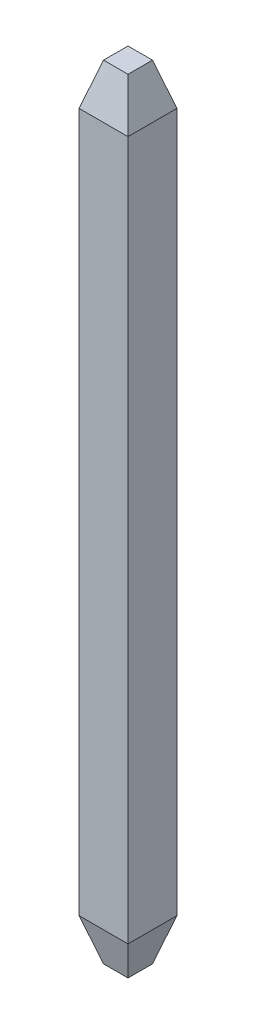
ISO-10303-21;
HEADER;
FILE_DESCRIPTION(('STEP AP214'),'2;1');
FILE_NAME('part.step','',(''),(''),'','','');
FILE_SCHEMA(('AUTOMOTIVE_DESIGN { 1 0 10303 214 1 1 1 1 }'));
ENDSEC;
DATA;
#1=APPLICATION_CONTEXT('core data for automotive mechanical design processes');
#2=APPLICATION_PROTOCOL_DEFINITION('international standard','automotive_design',2000,#1);
#3=PRODUCT_CONTEXT('',#1,'mechanical');
#4=PRODUCT('Part','Part','',(#3));
#5=PRODUCT_RELATED_PRODUCT_CATEGORY('part','',(#4));
#6=PRODUCT_DEFINITION_FORMATION('','',#4);
#7=PRODUCT_DEFINITION_CONTEXT('part definition',#1,'design');
#8=PRODUCT_DEFINITION('design','',#6,#7);
#9=PRODUCT_DEFINITION_SHAPE('','',#8);
#10=(LENGTH_UNIT() NAMED_UNIT(*) SI_UNIT(.MILLI.,.METRE.));
#11=(NAMED_UNIT(*) PLANE_ANGLE_UNIT() SI_UNIT($,.RADIAN.));
#12=(NAMED_UNIT(*) SI_UNIT($,.STERADIAN.) SOLID_ANGLE_UNIT());
#13=UNCERTAINTY_MEASURE_WITH_UNIT(LENGTH_MEASURE(1.E-05),#10,'distance_accuracy_value','');
#14=(GEOMETRIC_REPRESENTATION_CONTEXT(3) GLOBAL_UNCERTAINTY_ASSIGNED_CONTEXT((#13)) GLOBAL_UNIT_ASSIGNED_CONTEXT((#10,
#11,#12)) REPRESENTATION_CONTEXT('',''));
#15=CARTESIAN_POINT('',(0.,0.,0.));
#16=DIRECTION('',(0.,0.,1.));
#17=DIRECTION('',(1.,0.,0.));
#18=AXIS2_PLACEMENT_3D('',#15,#16,#17);
#19=CARTESIAN_POINT('',(1.75000000001297,-0.965870106912661,-19.5199999999763));
#20=DIRECTION('',(0.959644900900968,0.281214622974643,0.));
#21=DIRECTION('',(0.,0.,-1.));
#22=AXIS2_PLACEMENT_3D('',#19,#20,#21);
#23=PLANE('',#22);
#24=DIRECTION('',(-0.270714017147727,0.923811583516618,0.270714017147727));
#25=VECTOR('',#24,1.);
#26=CARTESIAN_POINT('',(1.75000000001297,-0.965870106912661,-19.8399999999763));
#27=LINE('',#26,#25);
#28=CARTESIAN_POINT('',(1.75000000001294,-0.965870106912663,-19.8399999999763));
#29=VERTEX_POINT('',#28);
#30=CARTESIAN_POINT('',(1.59000000001294,-0.419870106912663,-19.6799999999763));
#31=VERTEX_POINT('',#30);
#32=EDGE_CURVE('E11',#29,#31,#27,.T.);
#33=ORIENTED_EDGE('',*,*,#32,.T.);
#34=DIRECTION('',(0.,0.,1.));
#35=VECTOR('',#34,1.);
#36=CARTESIAN_POINT('',(1.59000000001297,-0.419870106912661,-19.6799999999763));
#37=LINE('',#36,#35);
#38=CARTESIAN_POINT('',(1.59000000001294,-0.419870106912663,-19.3599999999763));
#39=VERTEX_POINT('',#38);
#40=EDGE_CURVE('E28',#31,#39,#37,.T.);
#41=ORIENTED_EDGE('',*,*,#40,.T.);
#42=DIRECTION('',(-0.270714017147727,0.923811583516618,-0.270714017147727));
#43=VECTOR('',#42,1.);
#44=CARTESIAN_POINT('',(1.75000000001297,-0.965870106912661,-19.1999999999763));
#45=LINE('',#44,#43);
#46=CARTESIAN_POINT('',(1.75000000001294,-0.965870106912663,-19.1999999999763));
#47=VERTEX_POINT('',#46);
#48=EDGE_CURVE('E149',#47,#39,#45,.T.);
#49=ORIENTED_EDGE('',*,*,#48,.F.);
#50=DIRECTION('',(0.,0.,1.));
#51=VECTOR('',#50,1.);
#52=CARTESIAN_POINT('',(1.75000000001297,-0.965870106912661,-19.8399999999763));
#53=LINE('',#52,#51);
#54=EDGE_CURVE('E144',#29,#47,#53,.T.);
#55=ORIENTED_EDGE('',*,*,#54,.F.);
#56=EDGE_LOOP('',(#33,#41,#49,#55));
#57=FACE_BOUND('',#56,.T.);
#58=ADVANCED_FACE('F17',(#57),#23,.T.);
#59=CARTESIAN_POINT('',(1.43000000001296,-0.965870106912661,-19.8399999999763));
#60=DIRECTION('',(0.,0.281214622974643,-0.959644900900968));
#61=DIRECTION('',(-1.,0.,0.));
#62=AXIS2_PLACEMENT_3D('',#59,#60,#61);
#63=PLANE('',#62);
#64=DIRECTION('',(0.270714017147727,0.923811583516618,0.270714017147727));
#65=VECTOR('',#64,1.);
#66=CARTESIAN_POINT('',(1.11000000001295,-0.965870106912661,-19.8399999999763));
#67=LINE('',#66,#65);
#68=CARTESIAN_POINT('',(1.11000000001295,-0.965870106912663,-19.8399999999763));
#69=VERTEX_POINT('',#68);
#70=CARTESIAN_POINT('',(1.27000000001295,-0.419870106912663,-19.6799999999763));
#71=VERTEX_POINT('',#70);
#72=EDGE_CURVE('E167',#69,#71,#67,.T.);
#73=ORIENTED_EDGE('',*,*,#72,.T.);
#74=DIRECTION('',(1.,0.,0.));
#75=VECTOR('',#74,1.);
#76=CARTESIAN_POINT('',(1.27000000001295,-0.419870106912661,-19.6799999999763));
#77=LINE('',#76,#75);
#78=EDGE_CURVE('E126',#71,#31,#77,.T.);
#79=ORIENTED_EDGE('',*,*,#78,.T.);
#80=ORIENTED_EDGE('',*,*,#32,.F.);
#81=DIRECTION('',(1.,0.,0.));
#82=VECTOR('',#81,1.);
#83=CARTESIAN_POINT('',(1.11000000001295,-0.965870106912661,-19.8399999999763));
#84=LINE('',#83,#82);
#85=EDGE_CURVE('E152',#69,#29,#84,.T.);
#86=ORIENTED_EDGE('',*,*,#85,.F.);
#87=EDGE_LOOP('',(#73,#79,#80,#86));
#88=FACE_BOUND('',#87,.T.);
#89=ADVANCED_FACE('F235',(#88),#63,.T.);
#90=CARTESIAN_POINT('',(1.11000000001295,-0.965870106912661,-19.5199999999763));
#91=DIRECTION('',(-0.959644900900968,0.281214622974643,0.));
#92=DIRECTION('',(0.,0.,1.));
#93=AXIS2_PLACEMENT_3D('',#90,#91,#92);
#94=PLANE('',#93);
#95=DIRECTION('',(0.270714017147727,0.923811583516618,-0.270714017147727));
#96=VECTOR('',#95,1.);
#97=CARTESIAN_POINT('',(1.11000000001295,-0.965870106912661,-19.1999999999763));
#98=LINE('',#97,#96);
#99=CARTESIAN_POINT('',(1.11000000001295,-0.965870106912663,-19.1999999999763));
#100=VERTEX_POINT('',#99);
#101=CARTESIAN_POINT('',(1.27000000001295,-0.419870106912663,-19.3599999999763));
#102=VERTEX_POINT('',#101);
#103=EDGE_CURVE('E180',#100,#102,#98,.T.);
#104=ORIENTED_EDGE('',*,*,#103,.T.);
#105=DIRECTION('',(0.,0.,-1.));
#106=VECTOR('',#105,1.);
#107=CARTESIAN_POINT('',(1.27000000001295,-0.419870106912661,-19.3599999999763));
#108=LINE('',#107,#106);
#109=EDGE_CURVE('E142',#102,#71,#108,.T.);
#110=ORIENTED_EDGE('',*,*,#109,.T.);
#111=ORIENTED_EDGE('',*,*,#72,.F.);
#112=DIRECTION('',(0.,0.,-1.));
#113=VECTOR('',#112,1.);
#114=CARTESIAN_POINT('',(1.11000000001295,-0.965870106912661,-19.1999999999763));
#115=LINE('',#114,#113);
#116=EDGE_CURVE('E143',#100,#69,#115,.T.);
#117=ORIENTED_EDGE('',*,*,#116,.F.);
#118=EDGE_LOOP('',(#104,#110,#111,#117));
#119=FACE_BOUND('',#118,.T.);
#120=ADVANCED_FACE('F214',(#119),#94,.T.);
#121=CARTESIAN_POINT('',(1.11000000001295,-5.53543505344793,-19.1989999999763));
#122=DIRECTION('',(-1.,0.,0.));
#123=DIRECTION('',(0.,0.,1.));
#124=AXIS2_PLACEMENT_3D('',#121,#122,#123);
#125=PLANE('',#124);
#126=DIRECTION('',(0.,1.,0.));
#127=VECTOR('',#126,1.);
#128=CARTESIAN_POINT('',(1.11000000001295,-10.1039999999832,-19.8399999999763));
#129=LINE('',#128,#127);
#130=CARTESIAN_POINT('',(1.11000000001295,-10.1039999999832,-19.8399999999763));
#131=VERTEX_POINT('',#130);
#132=EDGE_CURVE('E101',#131,#69,#129,.T.);
#133=ORIENTED_EDGE('',*,*,#132,.F.);
#134=DIRECTION('',(0.,0.,-1.));
#135=VECTOR('',#134,1.);
#136=CARTESIAN_POINT('',(1.11000000001295,-10.1039999999832,-19.1999999999763));
#137=LINE('',#136,#135);
#138=CARTESIAN_POINT('',(1.11000000001295,-10.1039999999832,-19.1999999999763));
#139=VERTEX_POINT('',#138);
#140=EDGE_CURVE('E96',#139,#131,#137,.T.);
#141=ORIENTED_EDGE('',*,*,#140,.F.);
#142=DIRECTION('',(0.,1.,0.));
#143=VECTOR('',#142,1.);
#144=CARTESIAN_POINT('',(1.11000000001295,-10.1039999999832,-19.1999999999763));
#145=LINE('',#144,#143);
#146=EDGE_CURVE('E138',#139,#100,#145,.T.);
#147=ORIENTED_EDGE('',*,*,#146,.T.);
#148=ORIENTED_EDGE('',*,*,#116,.T.);
#149=EDGE_LOOP('',(#133,#141,#147,#148));
#150=FACE_BOUND('',#149,.T.);
#151=ADVANCED_FACE('F218',(#150),#125,.T.);
#152=CARTESIAN_POINT('',(1.10900000001298,-5.53543505344793,-19.1999999999763));
#153=DIRECTION('',(0.,0.,1.));
#154=DIRECTION('',(1.,0.,0.));
#155=AXIS2_PLACEMENT_3D('',#152,#153,#154);
#156=PLANE('',#155);
#157=ORIENTED_EDGE('',*,*,#146,.F.);
#158=DIRECTION('',(-1.,0.,0.));
#159=VECTOR('',#158,1.);
#160=CARTESIAN_POINT('',(1.75000000001297,-10.1039999999832,-19.1999999999763));
#161=LINE('',#160,#159);
#162=CARTESIAN_POINT('',(1.75000000001294,-10.1039999999832,-19.1999999999763));
#163=VERTEX_POINT('',#162);
#164=EDGE_CURVE('E133',#163,#139,#161,.T.);
#165=ORIENTED_EDGE('',*,*,#164,.F.);
#166=DIRECTION('',(0.,1.,0.));
#167=VECTOR('',#166,1.);
#168=CARTESIAN_POINT('',(1.75000000001297,-10.1039999999832,-19.1999999999763));
#169=LINE('',#168,#167);
#170=EDGE_CURVE('E132',#163,#47,#169,.T.);
#171=ORIENTED_EDGE('',*,*,#170,.T.);
#172=DIRECTION('',(-1.,0.,0.));
#173=VECTOR('',#172,1.);
#174=CARTESIAN_POINT('',(1.75000000001297,-0.965870106912661,-19.1999999999763));
#175=LINE('',#174,#173);
#176=EDGE_CURVE('E128',#47,#100,#175,.T.);
#177=ORIENTED_EDGE('',*,*,#176,.T.);
#178=EDGE_LOOP('',(#157,#165,#171,#177));
#179=FACE_BOUND('',#178,.T.);
#180=ADVANCED_FACE('F203',(#179),#156,.T.);
#181=CARTESIAN_POINT('',(1.43000000001296,-10.1039999999832,-19.1999999999763));
#182=DIRECTION('',(0.,-0.281214622974643,0.959644900900968));
#183=DIRECTION('',(-1.,0.,0.));
#184=AXIS2_PLACEMENT_3D('',#181,#182,#183);
#185=PLANE('',#184);
#186=ORIENTED_EDGE('',*,*,#164,.T.);
#187=DIRECTION('',(0.270714017147727,-0.923811583516618,-0.270714017147727));
#188=VECTOR('',#187,1.);
#189=CARTESIAN_POINT('',(1.11000000001295,-10.1039999999832,-19.1999999999763));
#190=LINE('',#189,#188);
#191=CARTESIAN_POINT('',(1.27000000001295,-10.6499999999832,-19.3599999999763));
#192=VERTEX_POINT('',#191);
#193=EDGE_CURVE('E134',#139,#192,#190,.T.);
#194=ORIENTED_EDGE('',*,*,#193,.T.);
#195=DIRECTION('',(-1.,0.,0.));
#196=VECTOR('',#195,1.);
#197=CARTESIAN_POINT('',(1.59000000001297,-10.6499999999832,-19.3599999999763));
#198=LINE('',#197,#196);
#199=CARTESIAN_POINT('',(1.59000000001294,-10.6499999999832,-19.3599999999763));
#200=VERTEX_POINT('',#199);
#201=EDGE_CURVE('E114',#200,#192,#198,.T.);
#202=ORIENTED_EDGE('',*,*,#201,.F.);
#203=DIRECTION('',(-0.270714017147727,-0.923811583516618,-0.270714017147727));
#204=VECTOR('',#203,1.);
#205=CARTESIAN_POINT('',(1.75000000001297,-10.1039999999832,-19.1999999999763));
#206=LINE('',#205,#204);
#207=EDGE_CURVE('E161',#163,#200,#206,.T.);
#208=ORIENTED_EDGE('',*,*,#207,.F.);
#209=EDGE_LOOP('',(#186,#194,#202,#208));
#210=FACE_BOUND('',#209,.T.);
#211=ADVANCED_FACE('F220',(#210),#185,.T.);
#212=CARTESIAN_POINT('',(1.75000000001297,-10.1039999999832,-19.5199999999763));
#213=DIRECTION('',(0.959644900900968,-0.281214622974643,0.));
#214=DIRECTION('',(0.,0.,-1.));
#215=AXIS2_PLACEMENT_3D('',#212,#213,#214);
#216=PLANE('',#215);
#217=DIRECTION('',(0.,0.,1.));
#218=VECTOR('',#217,1.);
#219=CARTESIAN_POINT('',(1.75000000001297,-10.1039999999832,-19.8399999999763));
#220=LINE('',#219,#218);
#221=CARTESIAN_POINT('',(1.75000000001294,-10.1039999999832,-19.8399999999763));
#222=VERTEX_POINT('',#221);
#223=EDGE_CURVE('E137',#222,#163,#220,.T.);
#224=ORIENTED_EDGE('',*,*,#223,.T.);
#225=ORIENTED_EDGE('',*,*,#207,.T.);
#226=DIRECTION('',(0.,0.,1.));
#227=VECTOR('',#226,1.);
#228=CARTESIAN_POINT('',(1.59000000001297,-10.6499999999832,-19.6799999999763));
#229=LINE('',#228,#227);
#230=CARTESIAN_POINT('',(1.59000000001294,-10.6499999999832,-19.6799999999763));
#231=VERTEX_POINT('',#230);
#232=EDGE_CURVE('E122',#231,#200,#229,.T.);
#233=ORIENTED_EDGE('',*,*,#232,.F.);
#234=DIRECTION('',(-0.270714017147727,-0.923811583516618,0.270714017147727));
#235=VECTOR('',#234,1.);
#236=CARTESIAN_POINT('',(1.75000000001297,-10.1039999999832,-19.8399999999763));
#237=LINE('',#236,#235);
#238=EDGE_CURVE('E107',#222,#231,#237,.T.);
#239=ORIENTED_EDGE('',*,*,#238,.F.);
#240=EDGE_LOOP('',(#224,#225,#233,#239));
#241=FACE_BOUND('',#240,.T.);
#242=ADVANCED_FACE('F384',(#241),#216,.T.);
#243=CARTESIAN_POINT('',(1.43000000001296,-10.1039999999832,-19.8399999999763));
#244=DIRECTION('',(0.,-0.281214622974643,-0.959644900900968));
#245=DIRECTION('',(0.,-0.959644900900968,0.281214622974643));
#246=AXIS2_PLACEMENT_3D('',#243,#244,#245);
#247=PLANE('',#246);
#248=DIRECTION('',(1.,0.,0.));
#249=VECTOR('',#248,1.);
#250=CARTESIAN_POINT('',(1.11000000001295,-10.1039999999832,-19.8399999999763));
#251=LINE('',#250,#249);
#252=EDGE_CURVE('E21',#131,#222,#251,.T.);
#253=ORIENTED_EDGE('',*,*,#252,.T.);
#254=ORIENTED_EDGE('',*,*,#238,.T.);
#255=DIRECTION('',(1.,0.,0.));
#256=VECTOR('',#255,1.);
#257=CARTESIAN_POINT('',(1.27000000001295,-10.6499999999832,-19.6799999999763));
#258=LINE('',#257,#256);
#259=CARTESIAN_POINT('',(1.27000000001295,-10.6499999999832,-19.6799999999763));
#260=VERTEX_POINT('',#259);
#261=EDGE_CURVE('E105',#260,#231,#258,.T.);
#262=ORIENTED_EDGE('',*,*,#261,.F.);
#263=DIRECTION('',(0.270714017147727,-0.923811583516618,0.270714017147727));
#264=VECTOR('',#263,1.);
#265=CARTESIAN_POINT('',(1.11000000001295,-10.1039999999832,-19.8399999999763));
#266=LINE('',#265,#264);
#267=EDGE_CURVE('E90',#131,#260,#266,.T.);
#268=ORIENTED_EDGE('',*,*,#267,.F.);
#269=EDGE_LOOP('',(#253,#254,#262,#268));
#270=FACE_BOUND('',#269,.T.);
#271=ADVANCED_FACE('F106',(#270),#247,.T.);
#272=CARTESIAN_POINT('',(1.26900000001297,-10.6499999999832,-19.5199999999763));
#273=DIRECTION('',(0.,-1.,0.));
#274=DIRECTION('',(0.,0.,-1.));
#275=AXIS2_PLACEMENT_3D('',#272,#273,#274);
#276=PLANE('',#275);
#277=ORIENTED_EDGE('',*,*,#232,.T.);
#278=ORIENTED_EDGE('',*,*,#201,.T.);
#279=DIRECTION('',(0.,0.,-1.));
#280=VECTOR('',#279,1.);
#281=CARTESIAN_POINT('',(1.27000000001295,-10.6499999999832,-19.3599999999763));
#282=LINE('',#281,#280);
#283=EDGE_CURVE('E95',#192,#260,#282,.T.);
#284=ORIENTED_EDGE('',*,*,#283,.T.);
#285=ORIENTED_EDGE('',*,*,#261,.T.);
#286=EDGE_LOOP('',(#277,#278,#284,#285));
#287=FACE_BOUND('',#286,.T.);
#288=ADVANCED_FACE('F113',(#287),#276,.T.);
#289=CARTESIAN_POINT('',(1.11000000001295,-10.1039999999832,-19.5199999999763));
#290=DIRECTION('',(-0.959644900900968,-0.281214622974643,0.));
#291=DIRECTION('',(-0.281214622974643,0.959644900900968,0.));
#292=AXIS2_PLACEMENT_3D('',#289,#290,#291);
#293=PLANE('',#292);
#294=ORIENTED_EDGE('',*,*,#140,.T.);
#295=ORIENTED_EDGE('',*,*,#267,.T.);
#296=ORIENTED_EDGE('',*,*,#283,.F.);
#297=ORIENTED_EDGE('',*,*,#193,.F.);
#298=EDGE_LOOP('',(#294,#295,#296,#297));
#299=FACE_BOUND('',#298,.T.);
#300=ADVANCED_FACE('F92',(#299),#293,.T.);
#301=CARTESIAN_POINT('',(1.75100000001297,-5.53443505344793,-19.8399999999763));
#302=DIRECTION('',(0.,0.,-1.));
#303=DIRECTION('',(0.,-1.,0.));
#304=AXIS2_PLACEMENT_3D('',#301,#302,#303);
#305=PLANE('',#304);
#306=DIRECTION('',(0.,1.,0.));
#307=VECTOR('',#306,1.);
#308=CARTESIAN_POINT('',(1.75000000001297,-10.1039999999832,-19.8399999999763));
#309=LINE('',#308,#307);
#310=EDGE_CURVE('E148',#222,#29,#309,.T.);
#311=ORIENTED_EDGE('',*,*,#310,.F.);
#312=ORIENTED_EDGE('',*,*,#252,.F.);
#313=ORIENTED_EDGE('',*,*,#132,.T.);
#314=ORIENTED_EDGE('',*,*,#85,.T.);
#315=EDGE_LOOP('',(#311,#312,#313,#314));
#316=FACE_BOUND('',#315,.T.);
#317=ADVANCED_FACE('F239',(#316),#305,.T.);
#318=CARTESIAN_POINT('',(1.75000000001297,-11.0738701069127,-19.5199999999763));
#319=DIRECTION('',(1.,0.,0.));
#320=DIRECTION('',(0.,1.,0.));
#321=AXIS2_PLACEMENT_3D('',#318,#319,#320);
#322=PLANE('',#321);
#323=ORIENTED_EDGE('',*,*,#170,.F.);
#324=ORIENTED_EDGE('',*,*,#223,.F.);
#325=ORIENTED_EDGE('',*,*,#310,.T.);
#326=ORIENTED_EDGE('',*,*,#54,.T.);
#327=EDGE_LOOP('',(#323,#324,#325,#326));
#328=FACE_BOUND('',#327,.T.);
#329=ADVANCED_FACE('F19',(#328),#322,.T.);
#330=CARTESIAN_POINT('',(1.43000000001296,-0.965870106912661,-19.1999999999763));
#331=DIRECTION('',(0.,0.281214622974643,0.959644900900968));
#332=DIRECTION('',(1.,0.,0.));
#333=AXIS2_PLACEMENT_3D('',#330,#331,#332);
#334=PLANE('',#333);
#335=ORIENTED_EDGE('',*,*,#48,.T.);
#336=DIRECTION('',(-1.,0.,0.));
#337=VECTOR('',#336,1.);
#338=CARTESIAN_POINT('',(1.59000000001297,-0.419870106912661,-19.3599999999763));
#339=LINE('',#338,#337);
#340=EDGE_CURVE('E157',#39,#102,#339,.T.);
#341=ORIENTED_EDGE('',*,*,#340,.T.);
#342=ORIENTED_EDGE('',*,*,#103,.F.);
#343=ORIENTED_EDGE('',*,*,#176,.F.);
#344=EDGE_LOOP('',(#335,#341,#342,#343));
#345=FACE_BOUND('',#344,.T.);
#346=ADVANCED_FACE('F212',(#345),#334,.T.);
#347=CARTESIAN_POINT('',(1.43000000001296,-0.419870106912661,-19.6809999999763));
#348=DIRECTION('',(0.,1.,0.));
#349=DIRECTION('',(1.,0.,0.));
#350=AXIS2_PLACEMENT_3D('',#347,#348,#349);
#351=PLANE('',#350);
#352=ORIENTED_EDGE('',*,*,#78,.F.);
#353=ORIENTED_EDGE('',*,*,#109,.F.);
#354=ORIENTED_EDGE('',*,*,#340,.F.);
#355=ORIENTED_EDGE('',*,*,#40,.F.);
#356=EDGE_LOOP('',(#352,#353,#354,#355));
#357=FACE_BOUND('',#356,.T.);
#358=ADVANCED_FACE('F231',(#357),#351,.T.);
#359=CLOSED_SHELL('',(#58,#89,#120,#151,#180,#211,#242,#271,#288,#300,#317,#329,#346,#358));
#360=MANIFOLD_SOLID_BREP('B1',#359);
#361=ADVANCED_BREP_SHAPE_REPRESENTATION('',(#18,#360),#14);
#362=SHAPE_DEFINITION_REPRESENTATION(#9,#361);
ENDSEC;
END-ISO-10303-21;
